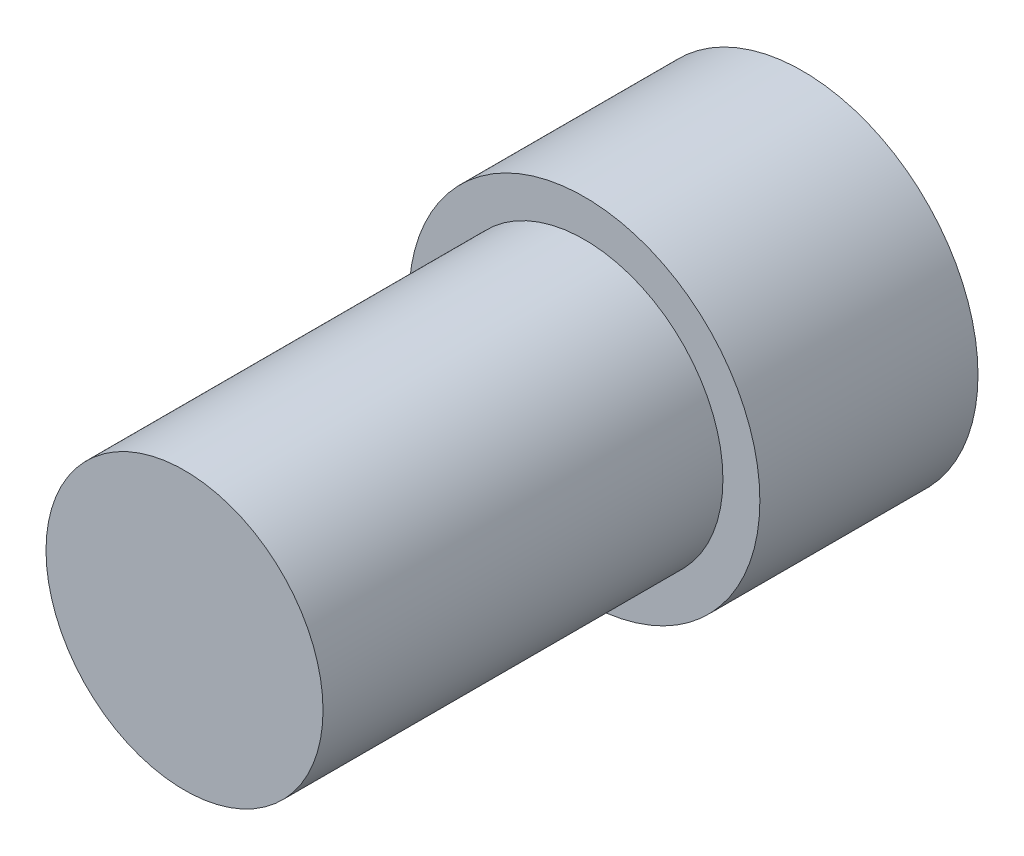
ISO-10303-21;
HEADER;
FILE_DESCRIPTION(('STEP AP214'),'2;1');
FILE_NAME('part.step','',(''),(''),'','','');
FILE_SCHEMA(('AUTOMOTIVE_DESIGN { 1 0 10303 214 1 1 1 1 }'));
ENDSEC;
DATA;
#1=APPLICATION_CONTEXT('core data for automotive mechanical design processes');
#2=APPLICATION_PROTOCOL_DEFINITION('international standard','automotive_design',2000,#1);
#3=PRODUCT_CONTEXT('',#1,'mechanical');
#4=PRODUCT('Part','Part','',(#3));
#5=PRODUCT_RELATED_PRODUCT_CATEGORY('part','',(#4));
#6=PRODUCT_DEFINITION_FORMATION('','',#4);
#7=PRODUCT_DEFINITION_CONTEXT('part definition',#1,'design');
#8=PRODUCT_DEFINITION('design','',#6,#7);
#9=PRODUCT_DEFINITION_SHAPE('','',#8);
#10=(LENGTH_UNIT() NAMED_UNIT(*) SI_UNIT(.MILLI.,.METRE.));
#11=(NAMED_UNIT(*) PLANE_ANGLE_UNIT() SI_UNIT($,.RADIAN.));
#12=(NAMED_UNIT(*) SI_UNIT($,.STERADIAN.) SOLID_ANGLE_UNIT());
#13=UNCERTAINTY_MEASURE_WITH_UNIT(LENGTH_MEASURE(1.E-05),#10,'distance_accuracy_value','');
#14=(GEOMETRIC_REPRESENTATION_CONTEXT(3) GLOBAL_UNCERTAINTY_ASSIGNED_CONTEXT((#13)) GLOBAL_UNIT_ASSIGNED_CONTEXT((#10,
#11,#12)) REPRESENTATION_CONTEXT('',''));
#15=CARTESIAN_POINT('',(0.,0.,0.));
#16=DIRECTION('',(0.,0.,1.));
#17=DIRECTION('',(1.,0.,0.));
#18=AXIS2_PLACEMENT_3D('',#15,#16,#17);
#19=CARTESIAN_POINT('',(0.,0.,6.));
#20=DIRECTION('',(0.,0.,-1.));
#21=DIRECTION('',(-1.,0.,0.));
#22=AXIS2_PLACEMENT_3D('',#19,#20,#21);
#23=CYLINDRICAL_SURFACE('',#22,4.826);
#24=CARTESIAN_POINT('',(0.,0.,6.));
#25=DIRECTION('',(0.,0.,1.));
#26=DIRECTION('',(1.,0.,0.));
#27=AXIS2_PLACEMENT_3D('',#24,#25,#26);
#28=CIRCLE('',#27,4.826);
#29=CARTESIAN_POINT('',(4.826,0.,6.));
#30=VERTEX_POINT('',#29);
#31=EDGE_CURVE('E45',#30,#30,#28,.T.);
#32=ORIENTED_EDGE('',*,*,#31,.F.);
#33=EDGE_LOOP('',(#32));
#34=FACE_BOUND('',#33,.T.);
#35=CARTESIAN_POINT('',(0.,0.,0.));
#36=DIRECTION('',(0.,0.,1.));
#37=DIRECTION('',(1.,0.,0.));
#38=AXIS2_PLACEMENT_3D('',#35,#36,#37);
#39=CIRCLE('',#38,4.826);
#40=CARTESIAN_POINT('',(4.826,0.,0.));
#41=VERTEX_POINT('',#40);
#42=EDGE_CURVE('E40',#41,#41,#39,.T.);
#43=ORIENTED_EDGE('',*,*,#42,.T.);
#44=EDGE_LOOP('',(#43));
#45=FACE_BOUND('',#44,.T.);
#46=ADVANCED_FACE('F37',(#34,#45),#23,.T.);
#47=CARTESIAN_POINT('',(0.,0.,6.));
#48=DIRECTION('',(0.,0.,1.));
#49=DIRECTION('',(1.,0.,0.));
#50=AXIS2_PLACEMENT_3D('',#47,#48,#49);
#51=PLANE('',#50);
#52=CARTESIAN_POINT('',(0.,0.,6.));
#53=DIRECTION('',(0.,0.,1.));
#54=DIRECTION('',(1.,0.,0.));
#55=AXIS2_PLACEMENT_3D('',#52,#53,#54);
#56=CIRCLE('',#55,3.81);
#57=CARTESIAN_POINT('',(3.81,0.,6.));
#58=VERTEX_POINT('',#57);
#59=EDGE_CURVE('E10',#58,#58,#56,.T.);
#60=ORIENTED_EDGE('',*,*,#59,.F.);
#61=EDGE_LOOP('',(#60));
#62=FACE_BOUND('',#61,.T.);
#63=ORIENTED_EDGE('',*,*,#31,.T.);
#64=EDGE_LOOP('',(#63));
#65=FACE_BOUND('',#64,.T.);
#66=ADVANCED_FACE('F65',(#62,#65),#51,.T.);
#67=CARTESIAN_POINT('',(0.,0.,0.));
#68=DIRECTION('',(0.,0.,1.));
#69=DIRECTION('',(1.,0.,0.));
#70=AXIS2_PLACEMENT_3D('',#67,#68,#69);
#71=PLANE('',#70);
#72=ORIENTED_EDGE('',*,*,#42,.F.);
#73=EDGE_LOOP('',(#72));
#74=FACE_BOUND('',#73,.T.);
#75=ADVANCED_FACE('F62',(#74),#71,.F.);
#76=CARTESIAN_POINT('',(0.,0.,17.));
#77=DIRECTION('',(0.,0.,-1.));
#78=DIRECTION('',(-1.,0.,0.));
#79=AXIS2_PLACEMENT_3D('',#76,#77,#78);
#80=CYLINDRICAL_SURFACE('',#79,3.81);
#81=CARTESIAN_POINT('',(0.,0.,17.));
#82=DIRECTION('',(0.,0.,1.));
#83=DIRECTION('',(1.,0.,0.));
#84=AXIS2_PLACEMENT_3D('',#81,#82,#83);
#85=CIRCLE('',#84,3.81);
#86=CARTESIAN_POINT('',(3.81,0.,17.));
#87=VERTEX_POINT('',#86);
#88=EDGE_CURVE('E52',#87,#87,#85,.T.);
#89=ORIENTED_EDGE('',*,*,#88,.F.);
#90=EDGE_LOOP('',(#89));
#91=FACE_BOUND('',#90,.T.);
#92=ORIENTED_EDGE('',*,*,#59,.T.);
#93=EDGE_LOOP('',(#92));
#94=FACE_BOUND('',#93,.T.);
#95=ADVANCED_FACE('F64',(#91,#94),#80,.T.);
#96=CARTESIAN_POINT('',(0.,0.,17.));
#97=DIRECTION('',(0.,0.,1.));
#98=DIRECTION('',(1.,0.,0.));
#99=AXIS2_PLACEMENT_3D('',#96,#97,#98);
#100=PLANE('',#99);
#101=ORIENTED_EDGE('',*,*,#88,.T.);
#102=EDGE_LOOP('',(#101));
#103=FACE_BOUND('',#102,.T.);
#104=ADVANCED_FACE('F70',(#103),#100,.T.);
#105=CLOSED_SHELL('',(#46,#66,#75,#95,#104));
#106=MANIFOLD_SOLID_BREP('B2',#105);
#107=ADVANCED_BREP_SHAPE_REPRESENTATION('',(#18,#106),#14);
#108=SHAPE_DEFINITION_REPRESENTATION(#9,#107);
ENDSEC;
END-ISO-10303-21;
